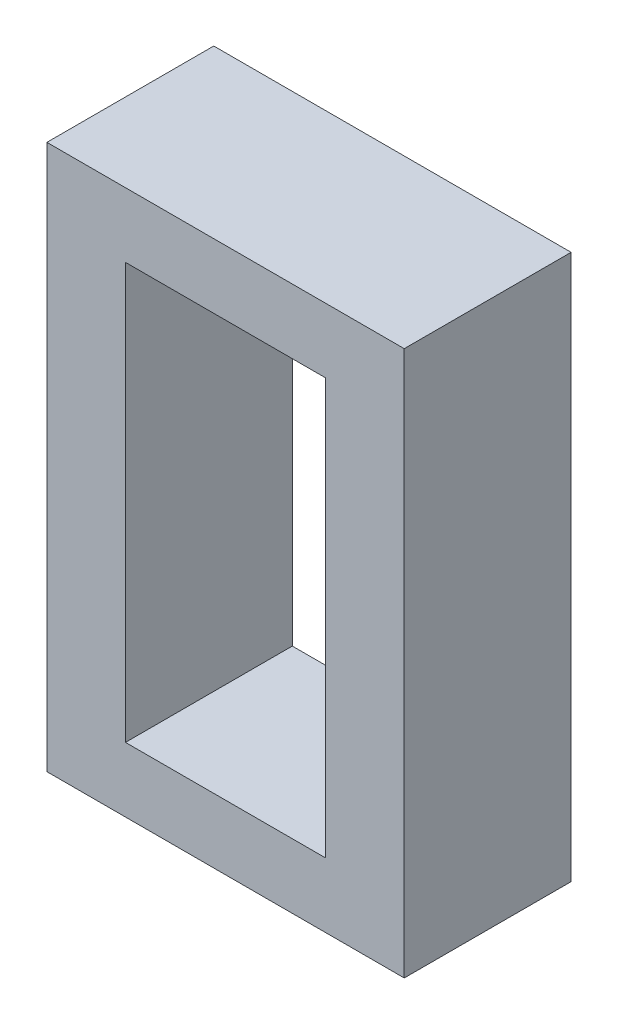
ISO-10303-21;
HEADER;
FILE_DESCRIPTION(('STEP AP214'),'2;1');
FILE_NAME('part.step','',(''),(''),'','','');
FILE_SCHEMA(('AUTOMOTIVE_DESIGN { 1 0 10303 214 1 1 1 1 }'));
ENDSEC;
DATA;
#1=APPLICATION_CONTEXT('core data for automotive mechanical design processes');
#2=APPLICATION_PROTOCOL_DEFINITION('international standard','automotive_design',2000,#1);
#3=PRODUCT_CONTEXT('',#1,'mechanical');
#4=PRODUCT('Part','Part','',(#3));
#5=PRODUCT_RELATED_PRODUCT_CATEGORY('part','',(#4));
#6=PRODUCT_DEFINITION_FORMATION('','',#4);
#7=PRODUCT_DEFINITION_CONTEXT('part definition',#1,'design');
#8=PRODUCT_DEFINITION('design','',#6,#7);
#9=PRODUCT_DEFINITION_SHAPE('','',#8);
#10=(LENGTH_UNIT() NAMED_UNIT(*) SI_UNIT(.MILLI.,.METRE.));
#11=(NAMED_UNIT(*) PLANE_ANGLE_UNIT() SI_UNIT($,.RADIAN.));
#12=(NAMED_UNIT(*) SI_UNIT($,.STERADIAN.) SOLID_ANGLE_UNIT());
#13=UNCERTAINTY_MEASURE_WITH_UNIT(LENGTH_MEASURE(1.E-05),#10,'distance_accuracy_value','');
#14=(GEOMETRIC_REPRESENTATION_CONTEXT(3) GLOBAL_UNCERTAINTY_ASSIGNED_CONTEXT((#13)) GLOBAL_UNIT_ASSIGNED_CONTEXT((#10,
#11,#12)) REPRESENTATION_CONTEXT('',''));
#15=CARTESIAN_POINT('',(0.,0.,0.));
#16=DIRECTION('',(0.,0.,1.));
#17=DIRECTION('',(1.,0.,0.));
#18=AXIS2_PLACEMENT_3D('',#15,#16,#17);
#19=CARTESIAN_POINT('',(0.,0.,12.));
#20=DIRECTION('',(0.,0.,-1.));
#21=DIRECTION('',(-1.,0.,0.));
#22=AXIS2_PLACEMENT_3D('',#19,#20,#21);
#23=PLANE('',#22);
#24=DIRECTION('',(0.,-1.,0.));
#25=VECTOR('',#24,1.);
#26=CARTESIAN_POINT('',(0.,0.,12.));
#27=LINE('',#26,#25);
#28=CARTESIAN_POINT('',(0.,39.2,12.));
#29=VERTEX_POINT('',#28);
#30=CARTESIAN_POINT('',(0.,0.,12.));
#31=VERTEX_POINT('',#30);
#32=EDGE_CURVE('E134',#29,#31,#27,.T.);
#33=ORIENTED_EDGE('',*,*,#32,.T.);
#34=DIRECTION('',(1.,0.,0.));
#35=VECTOR('',#34,1.);
#36=CARTESIAN_POINT('',(0.,0.,12.));
#37=LINE('',#36,#35);
#38=CARTESIAN_POINT('',(25.7,0.,12.));
#39=VERTEX_POINT('',#38);
#40=EDGE_CURVE('E137',#31,#39,#37,.T.);
#41=ORIENTED_EDGE('',*,*,#40,.T.);
#42=DIRECTION('',(0.,1.,0.));
#43=VECTOR('',#42,1.);
#44=CARTESIAN_POINT('',(25.7,0.,12.));
#45=LINE('',#44,#43);
#46=CARTESIAN_POINT('',(25.7,39.2,12.));
#47=VERTEX_POINT('',#46);
#48=EDGE_CURVE('E140',#39,#47,#45,.T.);
#49=ORIENTED_EDGE('',*,*,#48,.T.);
#50=DIRECTION('',(-1.,0.,0.));
#51=VECTOR('',#50,1.);
#52=CARTESIAN_POINT('',(0.,39.2,12.));
#53=LINE('',#52,#51);
#54=EDGE_CURVE('E142',#47,#29,#53,.T.);
#55=ORIENTED_EDGE('',*,*,#54,.T.);
#56=EDGE_LOOP('',(#33,#41,#49,#55));
#57=FACE_BOUND('',#56,.T.);
#58=DIRECTION('',(0.,-1.,0.));
#59=VECTOR('',#58,1.);
#60=CARTESIAN_POINT('',(5.64999999999999,4.65,12.));
#61=LINE('',#60,#59);
#62=CARTESIAN_POINT('',(5.64999999999999,34.55,12.));
#63=VERTEX_POINT('',#62);
#64=CARTESIAN_POINT('',(5.64999999999999,4.65,12.));
#65=VERTEX_POINT('',#64);
#66=EDGE_CURVE('E98',#63,#65,#61,.T.);
#67=ORIENTED_EDGE('',*,*,#66,.F.);
#68=DIRECTION('',(-1.,0.,0.));
#69=VECTOR('',#68,1.);
#70=CARTESIAN_POINT('',(5.64999999999999,34.55,12.));
#71=LINE('',#70,#69);
#72=CARTESIAN_POINT('',(20.05,34.55,12.));
#73=VERTEX_POINT('',#72);
#74=EDGE_CURVE('E120',#73,#63,#71,.T.);
#75=ORIENTED_EDGE('',*,*,#74,.F.);
#76=DIRECTION('',(0.,1.,0.));
#77=VECTOR('',#76,1.);
#78=CARTESIAN_POINT('',(20.05,4.65,12.));
#79=LINE('',#78,#77);
#80=CARTESIAN_POINT('',(20.05,4.65,12.));
#81=VERTEX_POINT('',#80);
#82=EDGE_CURVE('E118',#81,#73,#79,.T.);
#83=ORIENTED_EDGE('',*,*,#82,.F.);
#84=DIRECTION('',(1.,0.,0.));
#85=VECTOR('',#84,1.);
#86=CARTESIAN_POINT('',(5.64999999999999,4.65,12.));
#87=LINE('',#86,#85);
#88=EDGE_CURVE('E106',#65,#81,#87,.T.);
#89=ORIENTED_EDGE('',*,*,#88,.F.);
#90=EDGE_LOOP('',(#67,#75,#83,#89));
#91=FACE_BOUND('',#90,.T.);
#92=ADVANCED_FACE('F33',(#57,#91),#23,.F.);
#93=CARTESIAN_POINT('',(0.,0.,0.));
#94=DIRECTION('',(0.,0.,-1.));
#95=DIRECTION('',(-1.,0.,0.));
#96=AXIS2_PLACEMENT_3D('',#93,#94,#95);
#97=PLANE('',#96);
#98=DIRECTION('',(0.,-1.,0.));
#99=VECTOR('',#98,1.);
#100=CARTESIAN_POINT('',(0.,0.,0.));
#101=LINE('',#100,#99);
#102=CARTESIAN_POINT('',(0.,39.2,0.));
#103=VERTEX_POINT('',#102);
#104=CARTESIAN_POINT('',(0.,0.,0.));
#105=VERTEX_POINT('',#104);
#106=EDGE_CURVE('E114',#103,#105,#101,.T.);
#107=ORIENTED_EDGE('',*,*,#106,.F.);
#108=DIRECTION('',(-1.,0.,0.));
#109=VECTOR('',#108,1.);
#110=CARTESIAN_POINT('',(0.,39.2,0.));
#111=LINE('',#110,#109);
#112=CARTESIAN_POINT('',(25.7,39.2,0.));
#113=VERTEX_POINT('',#112);
#114=EDGE_CURVE('E138',#113,#103,#111,.T.);
#115=ORIENTED_EDGE('',*,*,#114,.F.);
#116=DIRECTION('',(0.,1.,0.));
#117=VECTOR('',#116,1.);
#118=CARTESIAN_POINT('',(25.7,0.,0.));
#119=LINE('',#118,#117);
#120=CARTESIAN_POINT('',(25.7,0.,0.));
#121=VERTEX_POINT('',#120);
#122=EDGE_CURVE('E149',#121,#113,#119,.T.);
#123=ORIENTED_EDGE('',*,*,#122,.F.);
#124=DIRECTION('',(1.,0.,0.));
#125=VECTOR('',#124,1.);
#126=CARTESIAN_POINT('',(0.,0.,0.));
#127=LINE('',#126,#125);
#128=EDGE_CURVE('E147',#105,#121,#127,.T.);
#129=ORIENTED_EDGE('',*,*,#128,.F.);
#130=EDGE_LOOP('',(#107,#115,#123,#129));
#131=FACE_BOUND('',#130,.T.);
#132=DIRECTION('',(-1.,0.,0.));
#133=VECTOR('',#132,1.);
#134=CARTESIAN_POINT('',(5.64999999999999,34.55,0.));
#135=LINE('',#134,#133);
#136=CARTESIAN_POINT('',(20.05,34.55,0.));
#137=VERTEX_POINT('',#136);
#138=CARTESIAN_POINT('',(5.64999999999999,34.55,0.));
#139=VERTEX_POINT('',#138);
#140=EDGE_CURVE('E107',#137,#139,#135,.T.);
#141=ORIENTED_EDGE('',*,*,#140,.T.);
#142=DIRECTION('',(0.,-1.,0.));
#143=VECTOR('',#142,1.);
#144=CARTESIAN_POINT('',(5.64999999999999,4.65,0.));
#145=LINE('',#144,#143);
#146=CARTESIAN_POINT('',(5.64999999999999,4.65,0.));
#147=VERTEX_POINT('',#146);
#148=EDGE_CURVE('E56',#139,#147,#145,.T.);
#149=ORIENTED_EDGE('',*,*,#148,.T.);
#150=DIRECTION('',(1.,0.,0.));
#151=VECTOR('',#150,1.);
#152=CARTESIAN_POINT('',(5.64999999999999,4.65,0.));
#153=LINE('',#152,#151);
#154=CARTESIAN_POINT('',(20.05,4.65,0.));
#155=VERTEX_POINT('',#154);
#156=EDGE_CURVE('E113',#147,#155,#153,.T.);
#157=ORIENTED_EDGE('',*,*,#156,.T.);
#158=DIRECTION('',(0.,1.,0.));
#159=VECTOR('',#158,1.);
#160=CARTESIAN_POINT('',(20.05,4.65,0.));
#161=LINE('',#160,#159);
#162=EDGE_CURVE('E126',#155,#137,#161,.T.);
#163=ORIENTED_EDGE('',*,*,#162,.T.);
#164=EDGE_LOOP('',(#141,#149,#157,#163));
#165=FACE_BOUND('',#164,.T.);
#166=ADVANCED_FACE('F167',(#131,#165),#97,.T.);
#167=CARTESIAN_POINT('',(0.,0.,12.));
#168=DIRECTION('',(1.,0.,0.));
#169=DIRECTION('',(0.,1.,0.));
#170=AXIS2_PLACEMENT_3D('',#167,#168,#169);
#171=PLANE('',#170);
#172=ORIENTED_EDGE('',*,*,#106,.T.);
#173=DIRECTION('',(0.,0.,-1.));
#174=VECTOR('',#173,1.);
#175=CARTESIAN_POINT('',(0.,0.,12.));
#176=LINE('',#175,#174);
#177=EDGE_CURVE('E11',#31,#105,#176,.T.);
#178=ORIENTED_EDGE('',*,*,#177,.F.);
#179=ORIENTED_EDGE('',*,*,#32,.F.);
#180=DIRECTION('',(0.,0.,-1.));
#181=VECTOR('',#180,1.);
#182=CARTESIAN_POINT('',(0.,39.2,12.));
#183=LINE('',#182,#181);
#184=EDGE_CURVE('E144',#29,#103,#183,.T.);
#185=ORIENTED_EDGE('',*,*,#184,.T.);
#186=EDGE_LOOP('',(#172,#178,#179,#185));
#187=FACE_BOUND('',#186,.T.);
#188=ADVANCED_FACE('F35',(#187),#171,.F.);
#189=CARTESIAN_POINT('',(0.,0.,12.));
#190=DIRECTION('',(0.,1.,0.));
#191=DIRECTION('',(0.,0.,1.));
#192=AXIS2_PLACEMENT_3D('',#189,#190,#191);
#193=PLANE('',#192);
#194=ORIENTED_EDGE('',*,*,#128,.T.);
#195=DIRECTION('',(0.,0.,-1.));
#196=VECTOR('',#195,1.);
#197=CARTESIAN_POINT('',(25.7,0.,12.));
#198=LINE('',#197,#196);
#199=EDGE_CURVE('E41',#39,#121,#198,.T.);
#200=ORIENTED_EDGE('',*,*,#199,.F.);
#201=ORIENTED_EDGE('',*,*,#40,.F.);
#202=ORIENTED_EDGE('',*,*,#177,.T.);
#203=EDGE_LOOP('',(#194,#200,#201,#202));
#204=FACE_BOUND('',#203,.T.);
#205=ADVANCED_FACE('F177',(#204),#193,.F.);
#206=CARTESIAN_POINT('',(25.7,0.,12.));
#207=DIRECTION('',(-1.,0.,0.));
#208=DIRECTION('',(0.,-1.,0.));
#209=AXIS2_PLACEMENT_3D('',#206,#207,#208);
#210=PLANE('',#209);
#211=ORIENTED_EDGE('',*,*,#122,.T.);
#212=DIRECTION('',(0.,0.,-1.));
#213=VECTOR('',#212,1.);
#214=CARTESIAN_POINT('',(25.7,39.2,12.));
#215=LINE('',#214,#213);
#216=EDGE_CURVE('E154',#47,#113,#215,.T.);
#217=ORIENTED_EDGE('',*,*,#216,.F.);
#218=ORIENTED_EDGE('',*,*,#48,.F.);
#219=ORIENTED_EDGE('',*,*,#199,.T.);
#220=EDGE_LOOP('',(#211,#217,#218,#219));
#221=FACE_BOUND('',#220,.T.);
#222=ADVANCED_FACE('F161',(#221),#210,.F.);
#223=CARTESIAN_POINT('',(0.,39.2,12.));
#224=DIRECTION('',(0.,-1.,0.));
#225=DIRECTION('',(0.,0.,-1.));
#226=AXIS2_PLACEMENT_3D('',#223,#224,#225);
#227=PLANE('',#226);
#228=ORIENTED_EDGE('',*,*,#114,.T.);
#229=ORIENTED_EDGE('',*,*,#184,.F.);
#230=ORIENTED_EDGE('',*,*,#54,.F.);
#231=ORIENTED_EDGE('',*,*,#216,.T.);
#232=EDGE_LOOP('',(#228,#229,#230,#231));
#233=FACE_BOUND('',#232,.T.);
#234=ADVANCED_FACE('F171',(#233),#227,.F.);
#235=CARTESIAN_POINT('',(5.64999999999999,4.65,12.));
#236=DIRECTION('',(1.,0.,0.));
#237=DIRECTION('',(0.,0.,-1.));
#238=AXIS2_PLACEMENT_3D('',#235,#236,#237);
#239=PLANE('',#238);
#240=ORIENTED_EDGE('',*,*,#148,.F.);
#241=DIRECTION('',(0.,0.,-1.));
#242=VECTOR('',#241,1.);
#243=CARTESIAN_POINT('',(5.64999999999999,34.55,12.));
#244=LINE('',#243,#242);
#245=EDGE_CURVE('E102',#63,#139,#244,.T.);
#246=ORIENTED_EDGE('',*,*,#245,.F.);
#247=ORIENTED_EDGE('',*,*,#66,.T.);
#248=DIRECTION('',(0.,0.,-1.));
#249=VECTOR('',#248,1.);
#250=CARTESIAN_POINT('',(5.64999999999999,4.65,12.));
#251=LINE('',#250,#249);
#252=EDGE_CURVE('E101',#65,#147,#251,.T.);
#253=ORIENTED_EDGE('',*,*,#252,.T.);
#254=EDGE_LOOP('',(#240,#246,#247,#253));
#255=FACE_BOUND('',#254,.T.);
#256=ADVANCED_FACE('F100',(#255),#239,.T.);
#257=CARTESIAN_POINT('',(5.64999999999999,4.65,12.));
#258=DIRECTION('',(0.,1.,0.));
#259=DIRECTION('',(0.,0.,1.));
#260=AXIS2_PLACEMENT_3D('',#257,#258,#259);
#261=PLANE('',#260);
#262=ORIENTED_EDGE('',*,*,#156,.F.);
#263=ORIENTED_EDGE('',*,*,#252,.F.);
#264=ORIENTED_EDGE('',*,*,#88,.T.);
#265=DIRECTION('',(0.,0.,-1.));
#266=VECTOR('',#265,1.);
#267=CARTESIAN_POINT('',(20.05,4.65,12.));
#268=LINE('',#267,#266);
#269=EDGE_CURVE('E115',#81,#155,#268,.T.);
#270=ORIENTED_EDGE('',*,*,#269,.T.);
#271=EDGE_LOOP('',(#262,#263,#264,#270));
#272=FACE_BOUND('',#271,.T.);
#273=ADVANCED_FACE('F110',(#272),#261,.T.);
#274=CARTESIAN_POINT('',(20.05,4.65,12.));
#275=DIRECTION('',(-1.,0.,0.));
#276=DIRECTION('',(0.,0.,1.));
#277=AXIS2_PLACEMENT_3D('',#274,#275,#276);
#278=PLANE('',#277);
#279=ORIENTED_EDGE('',*,*,#162,.F.);
#280=ORIENTED_EDGE('',*,*,#269,.F.);
#281=ORIENTED_EDGE('',*,*,#82,.T.);
#282=DIRECTION('',(0.,0.,-1.));
#283=VECTOR('',#282,1.);
#284=CARTESIAN_POINT('',(20.05,34.55,12.));
#285=LINE('',#284,#283);
#286=EDGE_CURVE('E48',#73,#137,#285,.T.);
#287=ORIENTED_EDGE('',*,*,#286,.T.);
#288=EDGE_LOOP('',(#279,#280,#281,#287));
#289=FACE_BOUND('',#288,.T.);
#290=ADVANCED_FACE('F200',(#289),#278,.T.);
#291=CARTESIAN_POINT('',(5.64999999999999,34.55,12.));
#292=DIRECTION('',(0.,-1.,0.));
#293=DIRECTION('',(0.,0.,-1.));
#294=AXIS2_PLACEMENT_3D('',#291,#292,#293);
#295=PLANE('',#294);
#296=ORIENTED_EDGE('',*,*,#140,.F.);
#297=ORIENTED_EDGE('',*,*,#286,.F.);
#298=ORIENTED_EDGE('',*,*,#74,.T.);
#299=ORIENTED_EDGE('',*,*,#245,.T.);
#300=EDGE_LOOP('',(#296,#297,#298,#299));
#301=FACE_BOUND('',#300,.T.);
#302=ADVANCED_FACE('F204',(#301),#295,.T.);
#303=CLOSED_SHELL('',(#92,#166,#188,#205,#222,#234,#256,#273,#290,#302));
#304=MANIFOLD_SOLID_BREP('B2',#303);
#305=ADVANCED_BREP_SHAPE_REPRESENTATION('',(#18,#304),#14);
#306=SHAPE_DEFINITION_REPRESENTATION(#9,#305);
ENDSEC;
END-ISO-10303-21;
